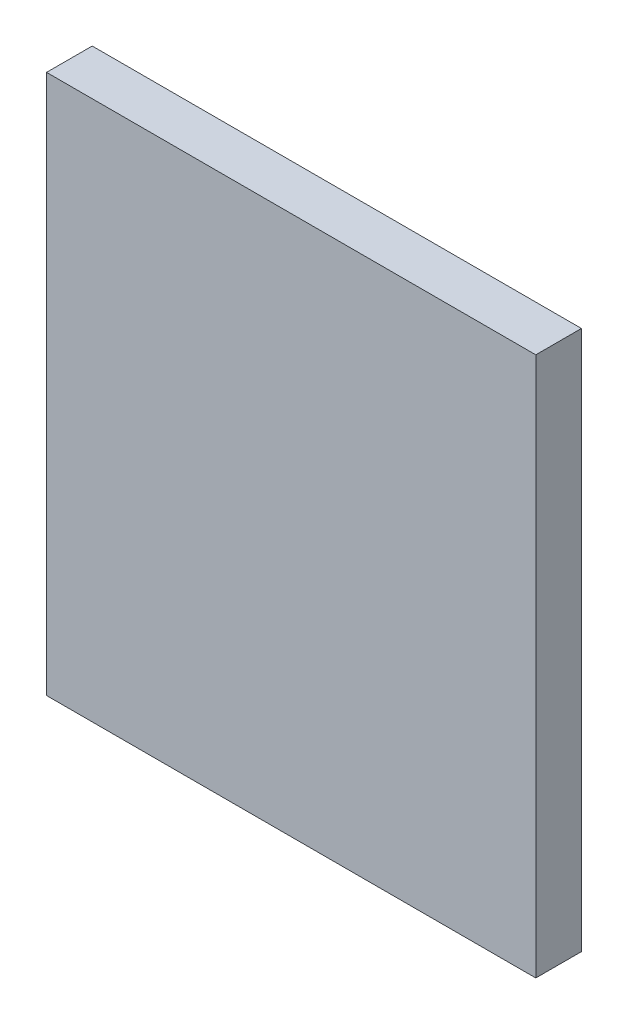
ISO-10303-21;
HEADER;
FILE_DESCRIPTION(('STEP AP214'),'2;1');
FILE_NAME('part.step','',(''),(''),'','','');
FILE_SCHEMA(('AUTOMOTIVE_DESIGN { 1 0 10303 214 1 1 1 1 }'));
ENDSEC;
DATA;
#1=APPLICATION_CONTEXT('core data for automotive mechanical design processes');
#2=APPLICATION_PROTOCOL_DEFINITION('international standard','automotive_design',2000,#1);
#3=PRODUCT_CONTEXT('',#1,'mechanical');
#4=PRODUCT('Part','Part','',(#3));
#5=PRODUCT_RELATED_PRODUCT_CATEGORY('part','',(#4));
#6=PRODUCT_DEFINITION_FORMATION('','',#4);
#7=PRODUCT_DEFINITION_CONTEXT('part definition',#1,'design');
#8=PRODUCT_DEFINITION('design','',#6,#7);
#9=PRODUCT_DEFINITION_SHAPE('','',#8);
#10=(LENGTH_UNIT() NAMED_UNIT(*) SI_UNIT(.MILLI.,.METRE.));
#11=(NAMED_UNIT(*) PLANE_ANGLE_UNIT() SI_UNIT($,.RADIAN.));
#12=(NAMED_UNIT(*) SI_UNIT($,.STERADIAN.) SOLID_ANGLE_UNIT());
#13=UNCERTAINTY_MEASURE_WITH_UNIT(LENGTH_MEASURE(1.E-05),#10,'distance_accuracy_value','');
#14=(GEOMETRIC_REPRESENTATION_CONTEXT(3) GLOBAL_UNCERTAINTY_ASSIGNED_CONTEXT((#13)) GLOBAL_UNIT_ASSIGNED_CONTEXT((#10,
#11,#12)) REPRESENTATION_CONTEXT('',''));
#15=CARTESIAN_POINT('',(0.,0.,0.));
#16=DIRECTION('',(0.,0.,1.));
#17=DIRECTION('',(1.,0.,0.));
#18=AXIS2_PLACEMENT_3D('',#15,#16,#17);
#19=CARTESIAN_POINT('',(0.,5.65,1.29));
#20=DIRECTION('',(0.,0.,-1.));
#21=DIRECTION('',(0.,-1.,0.));
#22=AXIS2_PLACEMENT_3D('',#19,#20,#21);
#23=PLANE('',#22);
#24=DIRECTION('',(0.,1.,0.));
#25=VECTOR('',#24,1.);
#26=CARTESIAN_POINT('',(-6.912,-1.975,1.29));
#27=LINE('',#26,#25);
#28=CARTESIAN_POINT('',(-6.912,-1.975,1.29));
#29=VERTEX_POINT('',#28);
#30=CARTESIAN_POINT('',(-6.912,13.275,1.29));
#31=VERTEX_POINT('',#30);
#32=EDGE_CURVE('E20',#29,#31,#27,.T.);
#33=ORIENTED_EDGE('',*,*,#32,.F.);
#34=DIRECTION('',(-1.,0.,0.));
#35=VECTOR('',#34,1.);
#36=CARTESIAN_POINT('',(6.912,-1.975,1.29));
#37=LINE('',#36,#35);
#38=CARTESIAN_POINT('',(6.912,-1.975,1.29));
#39=VERTEX_POINT('',#38);
#40=EDGE_CURVE('E104',#39,#29,#37,.T.);
#41=ORIENTED_EDGE('',*,*,#40,.F.);
#42=DIRECTION('',(0.,-1.,0.));
#43=VECTOR('',#42,1.);
#44=CARTESIAN_POINT('',(6.912,13.275,1.29));
#45=LINE('',#44,#43);
#46=CARTESIAN_POINT('',(6.912,13.275,1.29));
#47=VERTEX_POINT('',#46);
#48=EDGE_CURVE('E80',#47,#39,#45,.T.);
#49=ORIENTED_EDGE('',*,*,#48,.F.);
#50=DIRECTION('',(1.,0.,0.));
#51=VECTOR('',#50,1.);
#52=CARTESIAN_POINT('',(-6.912,13.275,1.29));
#53=LINE('',#52,#51);
#54=EDGE_CURVE('E85',#31,#47,#53,.T.);
#55=ORIENTED_EDGE('',*,*,#54,.F.);
#56=EDGE_LOOP('',(#33,#41,#49,#55));
#57=FACE_BOUND('',#56,.T.);
#58=ADVANCED_FACE('F17',(#57),#23,.F.);
#59=CARTESIAN_POINT('',(0.,5.65,0.));
#60=DIRECTION('',(0.,0.,-1.));
#61=DIRECTION('',(0.,-1.,0.));
#62=AXIS2_PLACEMENT_3D('',#59,#60,#61);
#63=PLANE('',#62);
#64=DIRECTION('',(1.,0.,0.));
#65=VECTOR('',#64,1.);
#66=CARTESIAN_POINT('',(-6.912,13.275,0.));
#67=LINE('',#66,#65);
#68=CARTESIAN_POINT('',(-6.912,13.275,0.));
#69=VERTEX_POINT('',#68);
#70=CARTESIAN_POINT('',(6.912,13.275,0.));
#71=VERTEX_POINT('',#70);
#72=EDGE_CURVE('E68',#69,#71,#67,.T.);
#73=ORIENTED_EDGE('',*,*,#72,.T.);
#74=DIRECTION('',(0.,-1.,0.));
#75=VECTOR('',#74,1.);
#76=CARTESIAN_POINT('',(6.912,13.275,0.));
#77=LINE('',#76,#75);
#78=CARTESIAN_POINT('',(6.912,-1.975,0.));
#79=VERTEX_POINT('',#78);
#80=EDGE_CURVE('E101',#71,#79,#77,.T.);
#81=ORIENTED_EDGE('',*,*,#80,.T.);
#82=DIRECTION('',(-1.,0.,0.));
#83=VECTOR('',#82,1.);
#84=CARTESIAN_POINT('',(6.912,-1.975,0.));
#85=LINE('',#84,#83);
#86=CARTESIAN_POINT('',(-6.912,-1.975,0.));
#87=VERTEX_POINT('',#86);
#88=EDGE_CURVE('E70',#79,#87,#85,.T.);
#89=ORIENTED_EDGE('',*,*,#88,.T.);
#90=DIRECTION('',(0.,1.,0.));
#91=VECTOR('',#90,1.);
#92=CARTESIAN_POINT('',(-6.912,-1.975,0.));
#93=LINE('',#92,#91);
#94=EDGE_CURVE('E11',#87,#69,#93,.T.);
#95=ORIENTED_EDGE('',*,*,#94,.T.);
#96=EDGE_LOOP('',(#73,#81,#89,#95));
#97=FACE_BOUND('',#96,.T.);
#98=ADVANCED_FACE('F66',(#97),#63,.T.);
#99=CARTESIAN_POINT('',(-6.912,-1.975,0.));
#100=DIRECTION('',(-1.,0.,0.));
#101=DIRECTION('',(0.,0.,1.));
#102=AXIS2_PLACEMENT_3D('',#99,#100,#101);
#103=PLANE('',#102);
#104=DIRECTION('',(0.,0.,1.));
#105=VECTOR('',#104,1.);
#106=CARTESIAN_POINT('',(-6.912,-1.975,0.));
#107=LINE('',#106,#105);
#108=EDGE_CURVE('E105',#87,#29,#107,.T.);
#109=ORIENTED_EDGE('',*,*,#108,.T.);
#110=ORIENTED_EDGE('',*,*,#32,.T.);
#111=DIRECTION('',(0.,0.,1.));
#112=VECTOR('',#111,1.);
#113=CARTESIAN_POINT('',(-6.912,13.275,0.));
#114=LINE('',#113,#112);
#115=EDGE_CURVE('E76',#69,#31,#114,.T.);
#116=ORIENTED_EDGE('',*,*,#115,.F.);
#117=ORIENTED_EDGE('',*,*,#94,.F.);
#118=EDGE_LOOP('',(#109,#110,#116,#117));
#119=FACE_BOUND('',#118,.T.);
#120=ADVANCED_FACE('F82',(#119),#103,.T.);
#121=CARTESIAN_POINT('',(6.912,-1.975,0.));
#122=DIRECTION('',(0.,-1.,0.));
#123=DIRECTION('',(0.,0.,-1.));
#124=AXIS2_PLACEMENT_3D('',#121,#122,#123);
#125=PLANE('',#124);
#126=DIRECTION('',(0.,0.,1.));
#127=VECTOR('',#126,1.);
#128=CARTESIAN_POINT('',(6.912,-1.975,0.));
#129=LINE('',#128,#127);
#130=EDGE_CURVE('E93',#79,#39,#129,.T.);
#131=ORIENTED_EDGE('',*,*,#130,.T.);
#132=ORIENTED_EDGE('',*,*,#40,.T.);
#133=ORIENTED_EDGE('',*,*,#108,.F.);
#134=ORIENTED_EDGE('',*,*,#88,.F.);
#135=EDGE_LOOP('',(#131,#132,#133,#134));
#136=FACE_BOUND('',#135,.T.);
#137=ADVANCED_FACE('F136',(#136),#125,.T.);
#138=CARTESIAN_POINT('',(6.912,13.275,0.));
#139=DIRECTION('',(1.,0.,0.));
#140=DIRECTION('',(0.,1.,0.));
#141=AXIS2_PLACEMENT_3D('',#138,#139,#140);
#142=PLANE('',#141);
#143=DIRECTION('',(0.,0.,1.));
#144=VECTOR('',#143,1.);
#145=CARTESIAN_POINT('',(6.912,13.275,0.));
#146=LINE('',#145,#144);
#147=EDGE_CURVE('E78',#71,#47,#146,.T.);
#148=ORIENTED_EDGE('',*,*,#147,.T.);
#149=ORIENTED_EDGE('',*,*,#48,.T.);
#150=ORIENTED_EDGE('',*,*,#130,.F.);
#151=ORIENTED_EDGE('',*,*,#80,.F.);
#152=EDGE_LOOP('',(#148,#149,#150,#151));
#153=FACE_BOUND('',#152,.T.);
#154=ADVANCED_FACE('F125',(#153),#142,.T.);
#155=CARTESIAN_POINT('',(-6.912,13.275,0.));
#156=DIRECTION('',(0.,1.,0.));
#157=DIRECTION('',(1.,0.,0.));
#158=AXIS2_PLACEMENT_3D('',#155,#156,#157);
#159=PLANE('',#158);
#160=ORIENTED_EDGE('',*,*,#115,.T.);
#161=ORIENTED_EDGE('',*,*,#54,.T.);
#162=ORIENTED_EDGE('',*,*,#147,.F.);
#163=ORIENTED_EDGE('',*,*,#72,.F.);
#164=EDGE_LOOP('',(#160,#161,#162,#163));
#165=FACE_BOUND('',#164,.T.);
#166=ADVANCED_FACE('F74',(#165),#159,.T.);
#167=CLOSED_SHELL('',(#58,#98,#120,#137,#154,#166));
#168=MANIFOLD_SOLID_BREP('B1',#167);
#169=ADVANCED_BREP_SHAPE_REPRESENTATION('',(#18,#168),#14);
#170=SHAPE_DEFINITION_REPRESENTATION(#9,#169);
ENDSEC;
END-ISO-10303-21;
